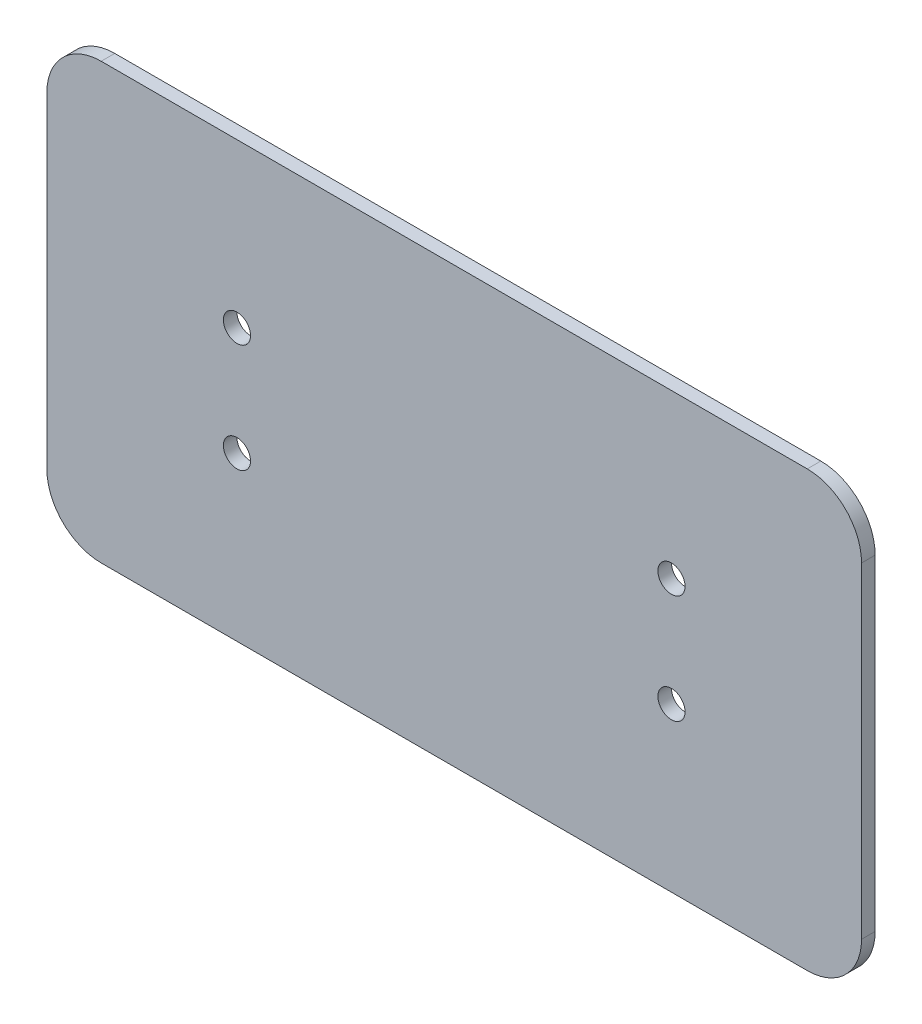
ISO-10303-21;
HEADER;
FILE_DESCRIPTION(('STEP AP214'),'2;1');
FILE_NAME('part.step','',(''),(''),'','','');
FILE_SCHEMA(('AUTOMOTIVE_DESIGN { 1 0 10303 214 1 1 1 1 }'));
ENDSEC;
DATA;
#1=APPLICATION_CONTEXT('core data for automotive mechanical design processes');
#2=APPLICATION_PROTOCOL_DEFINITION('international standard','automotive_design',2000,#1);
#3=PRODUCT_CONTEXT('',#1,'mechanical');
#4=PRODUCT('Part','Part','',(#3));
#5=PRODUCT_RELATED_PRODUCT_CATEGORY('part','',(#4));
#6=PRODUCT_DEFINITION_FORMATION('','',#4);
#7=PRODUCT_DEFINITION_CONTEXT('part definition',#1,'design');
#8=PRODUCT_DEFINITION('design','',#6,#7);
#9=PRODUCT_DEFINITION_SHAPE('','',#8);
#10=(LENGTH_UNIT() NAMED_UNIT(*) SI_UNIT(.MILLI.,.METRE.));
#11=(NAMED_UNIT(*) PLANE_ANGLE_UNIT() SI_UNIT($,.RADIAN.));
#12=(NAMED_UNIT(*) SI_UNIT($,.STERADIAN.) SOLID_ANGLE_UNIT());
#13=UNCERTAINTY_MEASURE_WITH_UNIT(LENGTH_MEASURE(1.E-05),#10,'distance_accuracy_value','');
#14=(GEOMETRIC_REPRESENTATION_CONTEXT(3) GLOBAL_UNCERTAINTY_ASSIGNED_CONTEXT((#13)) GLOBAL_UNIT_ASSIGNED_CONTEXT((#10,
#11,#12)) REPRESENTATION_CONTEXT('',''));
#15=CARTESIAN_POINT('',(0.,0.,0.));
#16=DIRECTION('',(0.,0.,1.));
#17=DIRECTION('',(1.,0.,0.));
#18=AXIS2_PLACEMENT_3D('',#15,#16,#17);
#19=CARTESIAN_POINT('',(0.,-204.758683658735,3.175));
#20=DIRECTION('',(0.,1.,0.));
#21=DIRECTION('',(-1.,0.,0.));
#22=AXIS2_PLACEMENT_3D('',#19,#20,#21);
#23=PLANE('',#22);
#24=DIRECTION('',(1.,0.,0.));
#25=VECTOR('',#24,1.);
#26=CARTESIAN_POINT('',(0.,-204.758683658735,0.));
#27=LINE('',#26,#25);
#28=CARTESIAN_POINT('',(296.179280684031,-204.758683658735,0.));
#29=VERTEX_POINT('',#28);
#30=CARTESIAN_POINT('',(461.279280684031,-204.758683658735,0.));
#31=VERTEX_POINT('',#30);
#32=EDGE_CURVE('E141',#29,#31,#27,.T.);
#33=ORIENTED_EDGE('',*,*,#32,.F.);
#34=DIRECTION('',(0.,0.,-1.));
#35=VECTOR('',#34,1.);
#36=CARTESIAN_POINT('',(296.179280684031,-204.758683658735,3.175));
#37=LINE('',#36,#35);
#38=CARTESIAN_POINT('',(296.179280684031,-204.758683658735,3.175));
#39=VERTEX_POINT('',#38);
#40=EDGE_CURVE('E11',#39,#29,#37,.T.);
#41=ORIENTED_EDGE('',*,*,#40,.F.);
#42=DIRECTION('',(1.,0.,0.));
#43=VECTOR('',#42,1.);
#44=CARTESIAN_POINT('',(0.,-204.758683658735,3.175));
#45=LINE('',#44,#43);
#46=CARTESIAN_POINT('',(461.279280684031,-204.758683658735,3.175));
#47=VERTEX_POINT('',#46);
#48=EDGE_CURVE('E326',#39,#47,#45,.T.);
#49=ORIENTED_EDGE('',*,*,#48,.T.);
#50=DIRECTION('',(0.,0.,-1.));
#51=VECTOR('',#50,1.);
#52=CARTESIAN_POINT('',(461.279280684031,-204.758683658735,3.175));
#53=LINE('',#52,#51);
#54=EDGE_CURVE('E52',#47,#31,#53,.T.);
#55=ORIENTED_EDGE('',*,*,#54,.T.);
#56=EDGE_LOOP('',(#33,#41,#49,#55));
#57=FACE_BOUND('',#56,.T.);
#58=ADVANCED_FACE('F35',(#57),#23,.T.);
#59=CARTESIAN_POINT('',(296.179280684031,-217.458683658735,3.175));
#60=DIRECTION('',(0.,0.,-1.));
#61=DIRECTION('',(-1.,0.,0.));
#62=AXIS2_PLACEMENT_3D('',#59,#60,#61);
#63=CYLINDRICAL_SURFACE('',#62,12.7);
#64=CARTESIAN_POINT('',(296.179280684031,-217.458683658735,0.));
#65=DIRECTION('',(0.,0.,1.));
#66=DIRECTION('',(1.,0.,0.));
#67=AXIS2_PLACEMENT_3D('',#64,#65,#66);
#68=CIRCLE('',#67,12.7);
#69=CARTESIAN_POINT('',(283.479280684031,-217.458683658735,0.));
#70=VERTEX_POINT('',#69);
#71=EDGE_CURVE('E143',#29,#70,#68,.T.);
#72=ORIENTED_EDGE('',*,*,#71,.T.);
#73=DIRECTION('',(0.,0.,-1.));
#74=VECTOR('',#73,1.);
#75=CARTESIAN_POINT('',(283.479280684031,-217.458683658735,3.175));
#76=LINE('',#75,#74);
#77=CARTESIAN_POINT('',(283.479280684031,-217.458683658735,3.175));
#78=VERTEX_POINT('',#77);
#79=EDGE_CURVE('E44',#78,#70,#76,.T.);
#80=ORIENTED_EDGE('',*,*,#79,.F.);
#81=CARTESIAN_POINT('',(296.179280684031,-217.458683658735,3.175));
#82=DIRECTION('',(0.,0.,1.));
#83=DIRECTION('',(1.,0.,0.));
#84=AXIS2_PLACEMENT_3D('',#81,#82,#83);
#85=CIRCLE('',#84,12.7);
#86=EDGE_CURVE('E322',#39,#78,#85,.T.);
#87=ORIENTED_EDGE('',*,*,#86,.F.);
#88=ORIENTED_EDGE('',*,*,#40,.T.);
#89=EDGE_LOOP('',(#72,#80,#87,#88));
#90=FACE_BOUND('',#89,.T.);
#91=ADVANCED_FACE('F180',(#90),#63,.T.);
#92=CARTESIAN_POINT('',(283.47928068403,2.06512614448549E-13,3.175));
#93=DIRECTION('',(1.,0.,0.));
#94=DIRECTION('',(0.,1.,0.));
#95=AXIS2_PLACEMENT_3D('',#92,#93,#94);
#96=PLANE('',#95);
#97=DIRECTION('',(0.,-1.,0.));
#98=VECTOR('',#97,1.);
#99=CARTESIAN_POINT('',(283.47928068403,2.06512614448549E-13,0.));
#100=LINE('',#99,#98);
#101=CARTESIAN_POINT('',(283.479280684031,-293.658683658735,0.));
#102=VERTEX_POINT('',#101);
#103=EDGE_CURVE('E146',#70,#102,#100,.T.);
#104=ORIENTED_EDGE('',*,*,#103,.T.);
#105=DIRECTION('',(0.,0.,-1.));
#106=VECTOR('',#105,1.);
#107=CARTESIAN_POINT('',(283.479280684031,-293.658683658735,3.175));
#108=LINE('',#107,#106);
#109=CARTESIAN_POINT('',(283.479280684031,-293.658683658735,3.175));
#110=VERTEX_POINT('',#109);
#111=EDGE_CURVE('E168',#110,#102,#108,.T.);
#112=ORIENTED_EDGE('',*,*,#111,.F.);
#113=DIRECTION('',(0.,-1.,0.));
#114=VECTOR('',#113,1.);
#115=CARTESIAN_POINT('',(283.47928068403,2.06512614448549E-13,3.175));
#116=LINE('',#115,#114);
#117=EDGE_CURVE('E176',#78,#110,#116,.T.);
#118=ORIENTED_EDGE('',*,*,#117,.F.);
#119=ORIENTED_EDGE('',*,*,#79,.T.);
#120=EDGE_LOOP('',(#104,#112,#118,#119));
#121=FACE_BOUND('',#120,.T.);
#122=ADVANCED_FACE('F173',(#121),#96,.F.);
#123=CARTESIAN_POINT('',(296.179280684031,-293.658683658735,3.175));
#124=DIRECTION('',(0.,0.,-1.));
#125=DIRECTION('',(-1.,0.,0.));
#126=AXIS2_PLACEMENT_3D('',#123,#124,#125);
#127=CYLINDRICAL_SURFACE('',#126,12.7);
#128=CARTESIAN_POINT('',(296.179280684031,-293.658683658735,0.));
#129=DIRECTION('',(0.,0.,1.));
#130=DIRECTION('',(1.,0.,0.));
#131=AXIS2_PLACEMENT_3D('',#128,#129,#130);
#132=CIRCLE('',#131,12.7);
#133=CARTESIAN_POINT('',(296.179280684031,-306.358683658735,0.));
#134=VERTEX_POINT('',#133);
#135=EDGE_CURVE('E149',#102,#134,#132,.T.);
#136=ORIENTED_EDGE('',*,*,#135,.T.);
#137=DIRECTION('',(0.,0.,-1.));
#138=VECTOR('',#137,1.);
#139=CARTESIAN_POINT('',(296.179280684031,-306.358683658735,3.175));
#140=LINE('',#139,#138);
#141=CARTESIAN_POINT('',(296.179280684031,-306.358683658735,3.175));
#142=VERTEX_POINT('',#141);
#143=EDGE_CURVE('E165',#142,#134,#140,.T.);
#144=ORIENTED_EDGE('',*,*,#143,.F.);
#145=CARTESIAN_POINT('',(296.179280684031,-293.658683658735,3.175));
#146=DIRECTION('',(0.,0.,1.));
#147=DIRECTION('',(1.,0.,0.));
#148=AXIS2_PLACEMENT_3D('',#145,#146,#147);
#149=CIRCLE('',#148,12.7);
#150=EDGE_CURVE('E320',#110,#142,#149,.T.);
#151=ORIENTED_EDGE('',*,*,#150,.F.);
#152=ORIENTED_EDGE('',*,*,#111,.T.);
#153=EDGE_LOOP('',(#136,#144,#151,#152));
#154=FACE_BOUND('',#153,.T.);
#155=ADVANCED_FACE('F236',(#154),#127,.T.);
#156=CARTESIAN_POINT('',(0.,-306.358683658735,3.175));
#157=DIRECTION('',(0.,1.,0.));
#158=DIRECTION('',(0.,0.,1.));
#159=AXIS2_PLACEMENT_3D('',#156,#157,#158);
#160=PLANE('',#159);
#161=DIRECTION('',(1.,0.,0.));
#162=VECTOR('',#161,1.);
#163=CARTESIAN_POINT('',(0.,-306.358683658735,0.));
#164=LINE('',#163,#162);
#165=CARTESIAN_POINT('',(461.279280684031,-306.358683658735,0.));
#166=VERTEX_POINT('',#165);
#167=EDGE_CURVE('E152',#134,#166,#164,.T.);
#168=ORIENTED_EDGE('',*,*,#167,.T.);
#169=DIRECTION('',(0.,0.,-1.));
#170=VECTOR('',#169,1.);
#171=CARTESIAN_POINT('',(461.279280684031,-306.358683658735,3.175));
#172=LINE('',#171,#170);
#173=CARTESIAN_POINT('',(461.279280684031,-306.358683658735,3.175));
#174=VERTEX_POINT('',#173);
#175=EDGE_CURVE('E121',#174,#166,#172,.T.);
#176=ORIENTED_EDGE('',*,*,#175,.F.);
#177=DIRECTION('',(1.,0.,0.));
#178=VECTOR('',#177,1.);
#179=CARTESIAN_POINT('',(0.,-306.358683658735,3.175));
#180=LINE('',#179,#178);
#181=EDGE_CURVE('E110',#142,#174,#180,.T.);
#182=ORIENTED_EDGE('',*,*,#181,.F.);
#183=ORIENTED_EDGE('',*,*,#143,.T.);
#184=EDGE_LOOP('',(#168,#176,#182,#183));
#185=FACE_BOUND('',#184,.T.);
#186=ADVANCED_FACE('F233',(#185),#160,.F.);
#187=CARTESIAN_POINT('',(461.279280684031,-293.658683658735,3.175));
#188=DIRECTION('',(0.,0.,-1.));
#189=DIRECTION('',(-1.,0.,0.));
#190=AXIS2_PLACEMENT_3D('',#187,#188,#189);
#191=CYLINDRICAL_SURFACE('',#190,12.7);
#192=CARTESIAN_POINT('',(461.279280684031,-293.658683658735,0.));
#193=DIRECTION('',(0.,0.,1.));
#194=DIRECTION('',(1.,0.,0.));
#195=AXIS2_PLACEMENT_3D('',#192,#193,#194);
#196=CIRCLE('',#195,12.7);
#197=CARTESIAN_POINT('',(473.979280684031,-293.658683658735,0.));
#198=VERTEX_POINT('',#197);
#199=EDGE_CURVE('E118',#166,#198,#196,.T.);
#200=ORIENTED_EDGE('',*,*,#199,.T.);
#201=DIRECTION('',(0.,0.,-1.));
#202=VECTOR('',#201,1.);
#203=CARTESIAN_POINT('',(473.979280684031,-293.658683658735,3.175));
#204=LINE('',#203,#202);
#205=CARTESIAN_POINT('',(473.979280684031,-293.658683658735,3.175));
#206=VERTEX_POINT('',#205);
#207=EDGE_CURVE('E116',#206,#198,#204,.T.);
#208=ORIENTED_EDGE('',*,*,#207,.F.);
#209=CARTESIAN_POINT('',(461.279280684031,-293.658683658735,3.175));
#210=DIRECTION('',(0.,0.,1.));
#211=DIRECTION('',(1.,0.,0.));
#212=AXIS2_PLACEMENT_3D('',#209,#210,#211);
#213=CIRCLE('',#212,12.7);
#214=EDGE_CURVE('E102',#174,#206,#213,.T.);
#215=ORIENTED_EDGE('',*,*,#214,.F.);
#216=ORIENTED_EDGE('',*,*,#175,.T.);
#217=EDGE_LOOP('',(#200,#208,#215,#216));
#218=FACE_BOUND('',#217,.T.);
#219=ADVANCED_FACE('F117',(#218),#191,.T.);
#220=CARTESIAN_POINT('',(473.97928068403,3.45290492526694E-13,3.175));
#221=DIRECTION('',(1.,0.,0.));
#222=DIRECTION('',(0.,1.,0.));
#223=AXIS2_PLACEMENT_3D('',#220,#221,#222);
#224=PLANE('',#223);
#225=DIRECTION('',(0.,-1.,0.));
#226=VECTOR('',#225,1.);
#227=CARTESIAN_POINT('',(473.97928068403,3.45290492526694E-13,0.));
#228=LINE('',#227,#226);
#229=CARTESIAN_POINT('',(473.979280684031,-217.458683658735,0.));
#230=VERTEX_POINT('',#229);
#231=EDGE_CURVE('E156',#230,#198,#228,.T.);
#232=ORIENTED_EDGE('',*,*,#231,.F.);
#233=DIRECTION('',(0.,0.,-1.));
#234=VECTOR('',#233,1.);
#235=CARTESIAN_POINT('',(473.979280684031,-217.458683658735,3.175));
#236=LINE('',#235,#234);
#237=CARTESIAN_POINT('',(473.979280684031,-217.458683658735,3.175));
#238=VERTEX_POINT('',#237);
#239=EDGE_CURVE('E77',#238,#230,#236,.T.);
#240=ORIENTED_EDGE('',*,*,#239,.F.);
#241=DIRECTION('',(0.,-1.,0.));
#242=VECTOR('',#241,1.);
#243=CARTESIAN_POINT('',(473.97928068403,3.45290492526694E-13,3.175));
#244=LINE('',#243,#242);
#245=EDGE_CURVE('E108',#238,#206,#244,.T.);
#246=ORIENTED_EDGE('',*,*,#245,.T.);
#247=ORIENTED_EDGE('',*,*,#207,.T.);
#248=EDGE_LOOP('',(#232,#240,#246,#247));
#249=FACE_BOUND('',#248,.T.);
#250=ADVANCED_FACE('F123',(#249),#224,.T.);
#251=CARTESIAN_POINT('',(327.929280684031,-268.258683658735,3.175));
#252=DIRECTION('',(0.,0.,-1.));
#253=DIRECTION('',(-1.,0.,0.));
#254=AXIS2_PLACEMENT_3D('',#251,#252,#253);
#255=CYLINDRICAL_SURFACE('',#254,3.17499999999997);
#256=CARTESIAN_POINT('',(327.929280684031,-268.258683658735,3.175));
#257=DIRECTION('',(0.,0.,1.));
#258=DIRECTION('',(1.,0.,0.));
#259=AXIS2_PLACEMENT_3D('',#256,#257,#258);
#260=CIRCLE('',#259,3.17499999999997);
#261=CARTESIAN_POINT('',(331.104280684031,-268.258683658735,3.175));
#262=VERTEX_POINT('',#261);
#263=EDGE_CURVE('E328',#262,#262,#260,.T.);
#264=ORIENTED_EDGE('',*,*,#263,.T.);
#265=EDGE_LOOP('',(#264));
#266=FACE_BOUND('',#265,.T.);
#267=CARTESIAN_POINT('',(327.929280684031,-268.258683658735,0.));
#268=DIRECTION('',(0.,0.,1.));
#269=DIRECTION('',(1.,0.,0.));
#270=AXIS2_PLACEMENT_3D('',#267,#268,#269);
#271=CIRCLE('',#270,3.17499999999997);
#272=CARTESIAN_POINT('',(331.104280684031,-268.258683658735,0.));
#273=VERTEX_POINT('',#272);
#274=EDGE_CURVE('E138',#273,#273,#271,.T.);
#275=ORIENTED_EDGE('',*,*,#274,.F.);
#276=EDGE_LOOP('',(#275));
#277=FACE_BOUND('',#276,.T.);
#278=ADVANCED_FACE('F191',(#266,#277),#255,.F.);
#279=CARTESIAN_POINT('',(327.929280684031,-242.858683658735,3.175));
#280=DIRECTION('',(0.,0.,-1.));
#281=DIRECTION('',(-1.,0.,0.));
#282=AXIS2_PLACEMENT_3D('',#279,#280,#281);
#283=CYLINDRICAL_SURFACE('',#282,3.17499999999997);
#284=CARTESIAN_POINT('',(327.929280684031,-242.858683658735,3.175));
#285=DIRECTION('',(0.,0.,1.));
#286=DIRECTION('',(1.,0.,0.));
#287=AXIS2_PLACEMENT_3D('',#284,#285,#286);
#288=CIRCLE('',#287,3.17499999999997);
#289=CARTESIAN_POINT('',(331.104280684031,-242.858683658735,3.175));
#290=VERTEX_POINT('',#289);
#291=EDGE_CURVE('E331',#290,#290,#288,.T.);
#292=ORIENTED_EDGE('',*,*,#291,.T.);
#293=EDGE_LOOP('',(#292));
#294=FACE_BOUND('',#293,.T.);
#295=CARTESIAN_POINT('',(327.929280684031,-242.858683658735,0.));
#296=DIRECTION('',(0.,0.,1.));
#297=DIRECTION('',(1.,0.,0.));
#298=AXIS2_PLACEMENT_3D('',#295,#296,#297);
#299=CIRCLE('',#298,3.17499999999997);
#300=CARTESIAN_POINT('',(331.104280684031,-242.858683658735,0.));
#301=VERTEX_POINT('',#300);
#302=EDGE_CURVE('E135',#301,#301,#299,.T.);
#303=ORIENTED_EDGE('',*,*,#302,.F.);
#304=EDGE_LOOP('',(#303));
#305=FACE_BOUND('',#304,.T.);
#306=ADVANCED_FACE('F194',(#294,#305),#283,.F.);
#307=CARTESIAN_POINT('',(429.529280684031,-242.858683658735,3.175));
#308=DIRECTION('',(0.,0.,-1.));
#309=DIRECTION('',(-1.,0.,0.));
#310=AXIS2_PLACEMENT_3D('',#307,#308,#309);
#311=CYLINDRICAL_SURFACE('',#310,3.17499999999997);
#312=CARTESIAN_POINT('',(429.529280684031,-242.858683658735,3.175));
#313=DIRECTION('',(0.,0.,1.));
#314=DIRECTION('',(1.,0.,0.));
#315=AXIS2_PLACEMENT_3D('',#312,#313,#314);
#316=CIRCLE('',#315,3.17499999999997);
#317=CARTESIAN_POINT('',(432.704280684031,-242.858683658735,3.175));
#318=VERTEX_POINT('',#317);
#319=EDGE_CURVE('E209',#318,#318,#316,.T.);
#320=ORIENTED_EDGE('',*,*,#319,.T.);
#321=EDGE_LOOP('',(#320));
#322=FACE_BOUND('',#321,.T.);
#323=CARTESIAN_POINT('',(429.529280684031,-242.858683658735,0.));
#324=DIRECTION('',(0.,0.,1.));
#325=DIRECTION('',(1.,0.,0.));
#326=AXIS2_PLACEMENT_3D('',#323,#324,#325);
#327=CIRCLE('',#326,3.17499999999997);
#328=CARTESIAN_POINT('',(432.704280684031,-242.858683658735,0.));
#329=VERTEX_POINT('',#328);
#330=EDGE_CURVE('E132',#329,#329,#327,.T.);
#331=ORIENTED_EDGE('',*,*,#330,.F.);
#332=EDGE_LOOP('',(#331));
#333=FACE_BOUND('',#332,.T.);
#334=ADVANCED_FACE('F197',(#322,#333),#311,.F.);
#335=CARTESIAN_POINT('',(429.529280684031,-268.258683658735,3.175));
#336=DIRECTION('',(0.,0.,-1.));
#337=DIRECTION('',(-1.,0.,0.));
#338=AXIS2_PLACEMENT_3D('',#335,#336,#337);
#339=CYLINDRICAL_SURFACE('',#338,3.17499999999997);
#340=CARTESIAN_POINT('',(429.529280684031,-268.258683658735,3.175));
#341=DIRECTION('',(0.,0.,1.));
#342=DIRECTION('',(1.,0.,0.));
#343=AXIS2_PLACEMENT_3D('',#340,#341,#342);
#344=CIRCLE('',#343,3.17499999999997);
#345=CARTESIAN_POINT('',(432.704280684031,-268.258683658735,3.175));
#346=VERTEX_POINT('',#345);
#347=EDGE_CURVE('E161',#346,#346,#344,.T.);
#348=ORIENTED_EDGE('',*,*,#347,.T.);
#349=EDGE_LOOP('',(#348));
#350=FACE_BOUND('',#349,.T.);
#351=CARTESIAN_POINT('',(429.529280684031,-268.258683658735,0.));
#352=DIRECTION('',(0.,0.,1.));
#353=DIRECTION('',(1.,0.,0.));
#354=AXIS2_PLACEMENT_3D('',#351,#352,#353);
#355=CIRCLE('',#354,3.17499999999997);
#356=CARTESIAN_POINT('',(432.704280684031,-268.258683658735,0.));
#357=VERTEX_POINT('',#356);
#358=EDGE_CURVE('E129',#357,#357,#355,.T.);
#359=ORIENTED_EDGE('',*,*,#358,.F.);
#360=EDGE_LOOP('',(#359));
#361=FACE_BOUND('',#360,.T.);
#362=ADVANCED_FACE('F37',(#350,#361),#339,.F.);
#363=CARTESIAN_POINT('',(461.279280684031,-217.458683658735,3.175));
#364=DIRECTION('',(0.,0.,-1.));
#365=DIRECTION('',(-1.,0.,0.));
#366=AXIS2_PLACEMENT_3D('',#363,#364,#365);
#367=CYLINDRICAL_SURFACE('',#366,12.7);
#368=CARTESIAN_POINT('',(461.279280684031,-217.458683658735,0.));
#369=DIRECTION('',(0.,0.,1.));
#370=DIRECTION('',(1.,0.,0.));
#371=AXIS2_PLACEMENT_3D('',#368,#369,#370);
#372=CIRCLE('',#371,12.7);
#373=EDGE_CURVE('E158',#31,#230,#372,.F.);
#374=ORIENTED_EDGE('',*,*,#373,.F.);
#375=ORIENTED_EDGE('',*,*,#54,.F.);
#376=CARTESIAN_POINT('',(461.279280684031,-217.458683658735,3.175));
#377=DIRECTION('',(0.,0.,1.));
#378=DIRECTION('',(1.,0.,0.));
#379=AXIS2_PLACEMENT_3D('',#376,#377,#378);
#380=CIRCLE('',#379,12.7);
#381=EDGE_CURVE('E124',#47,#238,#380,.F.);
#382=ORIENTED_EDGE('',*,*,#381,.T.);
#383=ORIENTED_EDGE('',*,*,#239,.T.);
#384=EDGE_LOOP('',(#374,#375,#382,#383));
#385=FACE_BOUND('',#384,.T.);
#386=ADVANCED_FACE('F204',(#385),#367,.T.);
#387=CARTESIAN_POINT('',(0.,0.,3.175));
#388=DIRECTION('',(0.,0.,1.));
#389=DIRECTION('',(1.,0.,0.));
#390=AXIS2_PLACEMENT_3D('',#387,#388,#389);
#391=PLANE('',#390);
#392=ORIENTED_EDGE('',*,*,#347,.F.);
#393=EDGE_LOOP('',(#392));
#394=FACE_BOUND('',#393,.T.);
#395=ORIENTED_EDGE('',*,*,#319,.F.);
#396=EDGE_LOOP('',(#395));
#397=FACE_BOUND('',#396,.T.);
#398=ORIENTED_EDGE('',*,*,#291,.F.);
#399=EDGE_LOOP('',(#398));
#400=FACE_BOUND('',#399,.T.);
#401=ORIENTED_EDGE('',*,*,#263,.F.);
#402=EDGE_LOOP('',(#401));
#403=FACE_BOUND('',#402,.T.);
#404=ORIENTED_EDGE('',*,*,#48,.F.);
#405=ORIENTED_EDGE('',*,*,#86,.T.);
#406=ORIENTED_EDGE('',*,*,#117,.T.);
#407=ORIENTED_EDGE('',*,*,#150,.T.);
#408=ORIENTED_EDGE('',*,*,#181,.T.);
#409=ORIENTED_EDGE('',*,*,#214,.T.);
#410=ORIENTED_EDGE('',*,*,#245,.F.);
#411=ORIENTED_EDGE('',*,*,#381,.F.);
#412=EDGE_LOOP('',(#404,#405,#406,#407,#408,#409,#410,#411));
#413=FACE_BOUND('',#412,.T.);
#414=ADVANCED_FACE('F105',(#394,#397,#400,#403,#413),#391,.T.);
#415=CARTESIAN_POINT('',(0.,0.,0.));
#416=DIRECTION('',(0.,0.,1.));
#417=DIRECTION('',(1.,0.,0.));
#418=AXIS2_PLACEMENT_3D('',#415,#416,#417);
#419=PLANE('',#418);
#420=ORIENTED_EDGE('',*,*,#358,.T.);
#421=EDGE_LOOP('',(#420));
#422=FACE_BOUND('',#421,.T.);
#423=ORIENTED_EDGE('',*,*,#330,.T.);
#424=EDGE_LOOP('',(#423));
#425=FACE_BOUND('',#424,.T.);
#426=ORIENTED_EDGE('',*,*,#302,.T.);
#427=EDGE_LOOP('',(#426));
#428=FACE_BOUND('',#427,.T.);
#429=ORIENTED_EDGE('',*,*,#274,.T.);
#430=EDGE_LOOP('',(#429));
#431=FACE_BOUND('',#430,.T.);
#432=ORIENTED_EDGE('',*,*,#32,.T.);
#433=ORIENTED_EDGE('',*,*,#373,.T.);
#434=ORIENTED_EDGE('',*,*,#231,.T.);
#435=ORIENTED_EDGE('',*,*,#199,.F.);
#436=ORIENTED_EDGE('',*,*,#167,.F.);
#437=ORIENTED_EDGE('',*,*,#135,.F.);
#438=ORIENTED_EDGE('',*,*,#103,.F.);
#439=ORIENTED_EDGE('',*,*,#71,.F.);
#440=EDGE_LOOP('',(#432,#433,#434,#435,#436,#437,#438,#439));
#441=FACE_BOUND('',#440,.T.);
#442=ADVANCED_FACE('F182',(#422,#425,#428,#431,#441),#419,.F.);
#443=CLOSED_SHELL('',(#58,#91,#122,#155,#186,#219,#250,#278,#306,#334,#362,#386,#414,#442));
#444=MANIFOLD_SOLID_BREP('B2',#443);
#445=ADVANCED_BREP_SHAPE_REPRESENTATION('',(#18,#444),#14);
#446=SHAPE_DEFINITION_REPRESENTATION(#9,#445);
ENDSEC;
END-ISO-10303-21;
